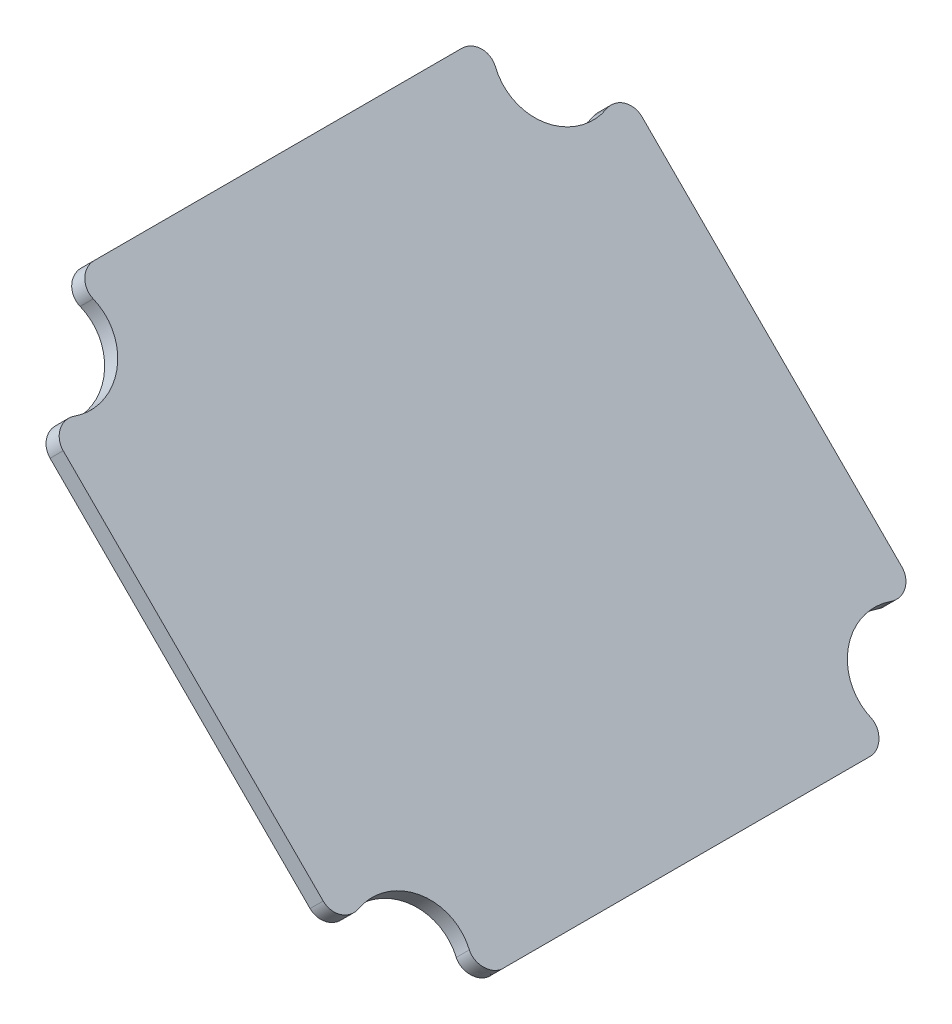
ISO-10303-21;
HEADER;
FILE_DESCRIPTION(('STEP AP214'),'2;1');
FILE_NAME('part.step','',(''),(''),'','','');
FILE_SCHEMA(('AUTOMOTIVE_DESIGN { 1 0 10303 214 1 1 1 1 }'));
ENDSEC;
DATA;
#1=APPLICATION_CONTEXT('core data for automotive mechanical design processes');
#2=APPLICATION_PROTOCOL_DEFINITION('international standard','automotive_design',2000,#1);
#3=PRODUCT_CONTEXT('',#1,'mechanical');
#4=PRODUCT('Part','Part','',(#3));
#5=PRODUCT_RELATED_PRODUCT_CATEGORY('part','',(#4));
#6=PRODUCT_DEFINITION_FORMATION('','',#4);
#7=PRODUCT_DEFINITION_CONTEXT('part definition',#1,'design');
#8=PRODUCT_DEFINITION('design','',#6,#7);
#9=PRODUCT_DEFINITION_SHAPE('','',#8);
#10=(LENGTH_UNIT() NAMED_UNIT(*) SI_UNIT(.MILLI.,.METRE.));
#11=(NAMED_UNIT(*) PLANE_ANGLE_UNIT() SI_UNIT($,.RADIAN.));
#12=(NAMED_UNIT(*) SI_UNIT($,.STERADIAN.) SOLID_ANGLE_UNIT());
#13=UNCERTAINTY_MEASURE_WITH_UNIT(LENGTH_MEASURE(1.E-05),#10,'distance_accuracy_value','');
#14=(GEOMETRIC_REPRESENTATION_CONTEXT(3) GLOBAL_UNCERTAINTY_ASSIGNED_CONTEXT((#13)) GLOBAL_UNIT_ASSIGNED_CONTEXT((#10,
#11,#12)) REPRESENTATION_CONTEXT('',''));
#15=CARTESIAN_POINT('',(0.,0.,0.));
#16=DIRECTION('',(0.,0.,1.));
#17=DIRECTION('',(1.,0.,0.));
#18=AXIS2_PLACEMENT_3D('',#15,#16,#17);
#19=CARTESIAN_POINT('',(16.1150195414016,24.5794856354689,12.5));
#20=DIRECTION('',(0.707106781186551,0.707106781186544,0.));
#21=DIRECTION('',(-0.707106781186544,0.707106781186551,0.));
#22=AXIS2_PLACEMENT_3D('',#19,#20,#21);
#23=CYLINDRICAL_SURFACE('',#22,2.6039506909341);
#24=CARTESIAN_POINT('',(16.7670598461853,25.2315259402525,12.5));
#25=DIRECTION('',(-0.707106781186551,-0.707106781186544,0.));
#26=DIRECTION('',(-0.202030508910427,0.20203050891043,-0.958314847499916));
#27=AXIS2_PLACEMENT_3D('',#24,#25,#26);
#28=CIRCLE('',#27,2.6039506909341);
#29=CARTESIAN_POINT('',(16.2409823629182,25.7576034235196,10.0045953907202));
#30=VERTEX_POINT('',#29);
#31=CARTESIAN_POINT('',(18.5315773672112,23.4670084192266,13.2439859116955));
#32=VERTEX_POINT('',#31);
#33=EDGE_CURVE('E161',#30,#32,#28,.T.);
#34=ORIENTED_EDGE('',*,*,#33,.F.);
#35=DIRECTION('',(0.707106781186551,0.707106781186544,0.));
#36=VECTOR('',#35,1.);
#37=CARTESIAN_POINT('',(15.5889420581346,25.105563118736,10.0045953907202));
#38=LINE('',#37,#36);
#39=CARTESIAN_POINT('',(15.5889420581346,25.105563118736,10.0045953907202));
#40=VERTEX_POINT('',#39);
#41=EDGE_CURVE('E33',#40,#30,#38,.T.);
#42=ORIENTED_EDGE('',*,*,#41,.F.);
#43=CARTESIAN_POINT('',(16.1150195414016,24.5794856354689,12.5));
#44=DIRECTION('',(-0.707106781186551,-0.707106781186544,0.));
#45=DIRECTION('',(-0.202030508910427,0.20203050891043,-0.958314847499916));
#46=AXIS2_PLACEMENT_3D('',#43,#44,#45);
#47=CIRCLE('',#46,2.6039506909341);
#48=CARTESIAN_POINT('',(17.8795370624275,22.814968114443,13.2439859116955));
#49=VERTEX_POINT('',#48);
#50=EDGE_CURVE('E215',#40,#49,#47,.T.);
#51=ORIENTED_EDGE('',*,*,#50,.T.);
#52=DIRECTION('',(0.707106781186551,0.707106781186544,0.));
#53=VECTOR('',#52,1.);
#54=CARTESIAN_POINT('',(17.8795370624275,22.814968114443,13.2439859116955));
#55=LINE('',#54,#53);
#56=EDGE_CURVE('E11',#49,#32,#55,.T.);
#57=ORIENTED_EDGE('',*,*,#56,.T.);
#58=EDGE_LOOP('',(#34,#42,#51,#57));
#59=FACE_BOUND('',#58,.T.);
#60=ADVANCED_FACE('F17',(#59),#23,.F.);
#61=CARTESIAN_POINT('',(18.4867277865279,22.2077773903426,13.5));
#62=DIRECTION('',(0.707106781186551,0.707106781186544,0.));
#63=DIRECTION('',(-0.707106781186544,0.707106781186551,0.));
#64=AXIS2_PLACEMENT_3D('',#61,#62,#63);
#65=CYLINDRICAL_SURFACE('',#64,0.896049309065901);
#66=CARTESIAN_POINT('',(19.1387680913116,22.8598176951262,13.5));
#67=DIRECTION('',(0.707106781186551,0.707106781186544,0.));
#68=DIRECTION('',(-0.677630927178935,0.677630927178943,-0.285714285714284));
#69=AXIS2_PLACEMENT_3D('',#66,#67,#68);
#70=CIRCLE('',#69,0.896049309065901);
#71=CARTESIAN_POINT('',(19.1387680913116,22.8598176951262,14.3960493090659));
#72=VERTEX_POINT('',#71);
#73=EDGE_CURVE('E164',#32,#72,#70,.T.);
#74=ORIENTED_EDGE('',*,*,#73,.F.);
#75=ORIENTED_EDGE('',*,*,#56,.F.);
#76=CARTESIAN_POINT('',(18.4867277865279,22.2077773903426,13.5));
#77=DIRECTION('',(0.707106781186551,0.707106781186544,0.));
#78=DIRECTION('',(-0.677630927178935,0.677630927178943,-0.285714285714284));
#79=AXIS2_PLACEMENT_3D('',#76,#77,#78);
#80=CIRCLE('',#79,0.896049309065901);
#81=CARTESIAN_POINT('',(18.4867277865279,22.2077773903426,14.3960493090659));
#82=VERTEX_POINT('',#81);
#83=EDGE_CURVE('E240',#49,#82,#80,.T.);
#84=ORIENTED_EDGE('',*,*,#83,.T.);
#85=DIRECTION('',(0.707106781186551,0.707106781186544,0.));
#86=VECTOR('',#85,1.);
#87=CARTESIAN_POINT('',(18.4867277865279,22.2077773903426,14.3960493090659));
#88=LINE('',#87,#86);
#89=EDGE_CURVE('E25',#82,#72,#88,.T.);
#90=ORIENTED_EDGE('',*,*,#89,.T.);
#91=EDGE_LOOP('',(#74,#75,#84,#90));
#92=FACE_BOUND('',#91,.T.);
#93=ADVANCED_FACE('F239',(#92),#65,.T.);
#94=CARTESIAN_POINT('',(18.4867277865279,22.2077773903426,14.3960493090659));
#95=DIRECTION('',(0.,0.,1.));
#96=DIRECTION('',(1.,0.,0.));
#97=AXIS2_PLACEMENT_3D('',#94,#95,#96);
#98=PLANE('',#97);
#99=DIRECTION('',(0.707106781186544,-0.707106781186551,0.));
#100=VECTOR('',#99,1.);
#101=CARTESIAN_POINT('',(19.1387680913116,22.8598176951262,14.3960493090659));
#102=LINE('',#101,#100);
#103=CARTESIAN_POINT('',(32.0730211307226,9.92556465571507,14.3960493090659));
#104=VERTEX_POINT('',#103);
#105=EDGE_CURVE('E167',#72,#104,#102,.T.);
#106=ORIENTED_EDGE('',*,*,#105,.F.);
#107=ORIENTED_EDGE('',*,*,#89,.F.);
#108=DIRECTION('',(0.707106781186544,-0.707106781186551,0.));
#109=VECTOR('',#108,1.);
#110=CARTESIAN_POINT('',(18.4867277865279,22.2077773903426,14.3960493090659));
#111=LINE('',#110,#109);
#112=CARTESIAN_POINT('',(31.4209808259389,9.27352435093144,14.3960493090659));
#113=VERTEX_POINT('',#112);
#114=EDGE_CURVE('E249',#82,#113,#111,.T.);
#115=ORIENTED_EDGE('',*,*,#114,.T.);
#116=DIRECTION('',(0.707106781186551,0.707106781186544,0.));
#117=VECTOR('',#116,1.);
#118=CARTESIAN_POINT('',(31.4209808259389,9.27352435093144,14.3960493090659));
#119=LINE('',#118,#117);
#120=EDGE_CURVE('E237',#113,#104,#119,.T.);
#121=ORIENTED_EDGE('',*,*,#120,.T.);
#122=EDGE_LOOP('',(#106,#107,#115,#121));
#123=FACE_BOUND('',#122,.T.);
#124=ADVANCED_FACE('F244',(#123),#98,.T.);
#125=CARTESIAN_POINT('',(31.420980825939,9.27352435093142,13.5));
#126=DIRECTION('',(0.707106781186551,0.707106781186544,0.));
#127=DIRECTION('',(-0.707106781186544,0.707106781186551,0.));
#128=AXIS2_PLACEMENT_3D('',#125,#126,#127);
#129=CYLINDRICAL_SURFACE('',#128,0.896049309065901);
#130=CARTESIAN_POINT('',(32.0730211307226,9.92556465571506,13.5));
#131=DIRECTION('',(0.707106781186551,0.707106781186544,0.));
#132=DIRECTION('',(0.,0.,1.));
#133=AXIS2_PLACEMENT_3D('',#130,#131,#132);
#134=CIRCLE('',#133,0.896049309065901);
#135=CARTESIAN_POINT('',(32.680211854823,9.31837393161468,13.2439859116955));
#136=VERTEX_POINT('',#135);
#137=EDGE_CURVE('E170',#104,#136,#134,.T.);
#138=ORIENTED_EDGE('',*,*,#137,.F.);
#139=ORIENTED_EDGE('',*,*,#120,.F.);
#140=CARTESIAN_POINT('',(31.420980825939,9.27352435093142,13.5));
#141=DIRECTION('',(0.707106781186551,0.707106781186544,0.));
#142=DIRECTION('',(0.,0.,1.));
#143=AXIS2_PLACEMENT_3D('',#140,#141,#142);
#144=CIRCLE('',#143,0.896049309065901);
#145=CARTESIAN_POINT('',(32.0281715500393,8.66633362683105,13.2439859116955));
#146=VERTEX_POINT('',#145);
#147=EDGE_CURVE('E253',#113,#146,#144,.T.);
#148=ORIENTED_EDGE('',*,*,#147,.T.);
#149=DIRECTION('',(0.707106781186551,0.707106781186544,0.));
#150=VECTOR('',#149,1.);
#151=CARTESIAN_POINT('',(32.0281715500393,8.66633362683105,13.2439859116955));
#152=LINE('',#151,#150);
#153=EDGE_CURVE('E235',#146,#136,#152,.T.);
#154=ORIENTED_EDGE('',*,*,#153,.T.);
#155=EDGE_LOOP('',(#138,#139,#148,#154));
#156=FACE_BOUND('',#155,.T.);
#157=ADVANCED_FACE('F281',(#156),#129,.T.);
#158=CARTESIAN_POINT('',(33.7926890710652,6.90181610580512,12.5));
#159=DIRECTION('',(0.707106781186551,0.707106781186544,0.));
#160=DIRECTION('',(-0.707106781186544,0.707106781186551,0.));
#161=AXIS2_PLACEMENT_3D('',#158,#159,#160);
#162=CYLINDRICAL_SURFACE('',#161,2.6039506909341);
#163=CARTESIAN_POINT('',(34.4447293758489,7.55385641058876,12.5));
#164=DIRECTION('',(-0.707106781186551,-0.707106781186544,0.));
#165=DIRECTION('',(-0.677630927178935,0.677630927178942,0.285714285714285));
#166=AXIS2_PLACEMENT_3D('',#163,#164,#165);
#167=CIRCLE('',#166,2.6039506909341);
#168=CARTESIAN_POINT('',(34.9437513425845,7.05483444385308,9.99350576417047));
#169=VERTEX_POINT('',#168);
#170=EDGE_CURVE('E173',#136,#169,#167,.T.);
#171=ORIENTED_EDGE('',*,*,#170,.F.);
#172=ORIENTED_EDGE('',*,*,#153,.F.);
#173=CARTESIAN_POINT('',(33.7926890710652,6.90181610580512,12.5));
#174=DIRECTION('',(-0.707106781186551,-0.707106781186544,0.));
#175=DIRECTION('',(-0.677630927178935,0.677630927178942,0.285714285714285));
#176=AXIS2_PLACEMENT_3D('',#173,#174,#175);
#177=CIRCLE('',#176,2.6039506909341);
#178=CARTESIAN_POINT('',(34.2917110378009,6.40279413906944,9.99350576417047));
#179=VERTEX_POINT('',#178);
#180=EDGE_CURVE('E256',#146,#179,#177,.T.);
#181=ORIENTED_EDGE('',*,*,#180,.T.);
#182=DIRECTION('',(0.707106781186551,0.707106781186544,0.));
#183=VECTOR('',#182,1.);
#184=CARTESIAN_POINT('',(34.2917110378009,6.40279413906944,9.99350576417047));
#185=LINE('',#184,#183);
#186=EDGE_CURVE('E233',#179,#169,#185,.T.);
#187=ORIENTED_EDGE('',*,*,#186,.T.);
#188=EDGE_LOOP('',(#171,#172,#181,#187));
#189=FACE_BOUND('',#188,.T.);
#190=ADVANCED_FACE('F276',(#189),#162,.F.);
#191=CARTESIAN_POINT('',(34.2917110378009,6.40279413906944,9.99350576417047));
#192=CARTESIAN_POINT('',(34.6614578443524,6.03304733251817,10.1407327363789));
#193=CARTESIAN_POINT('',(35.1094049893612,5.5851001875092,9.70988638517898));
#194=CARTESIAN_POINT('',(35.1094049893612,5.58510018750918,9.14080700688087));
#195=B_SPLINE_CURVE_WITH_KNOTS('',3,(#191,#192,#193,#194),.UNSPECIFIED.,.F.,.F.,(4,4),(0.,1.),.UNSPECIFIED.);
#196=DIRECTION('',(0.707106781186551,0.707106781186544,0.));
#197=VECTOR('',#196,1.);
#198=SURFACE_OF_LINEAR_EXTRUSION('',#195,#197);
#199=CARTESIAN_POINT('',(34.9437513425845,7.05483444385307,9.99350576417047));
#200=CARTESIAN_POINT('',(35.3134981491361,6.68508763730181,10.1407327363789));
#201=CARTESIAN_POINT('',(35.7614452941448,6.23714049229283,9.70988638517898));
#202=CARTESIAN_POINT('',(35.7614452941448,6.23714049229281,9.14080700688087));
#203=B_SPLINE_CURVE_WITH_KNOTS('',3,(#199,#200,#201,#202),.UNSPECIFIED.,.F.,.F.,(4,4),(0.,1.),.UNSPECIFIED.);
#204=CARTESIAN_POINT('',(35.7614452941448,6.23714049229281,9.14080700688086));
#205=VERTEX_POINT('',#204);
#206=EDGE_CURVE('E176',#169,#205,#203,.T.);
#207=ORIENTED_EDGE('',*,*,#206,.F.);
#208=ORIENTED_EDGE('',*,*,#186,.F.);
#209=CARTESIAN_POINT('',(35.1094049893612,5.58510018750917,9.14080700688086));
#210=VERTEX_POINT('',#209);
#211=EDGE_CURVE('E259',#179,#210,#195,.T.);
#212=ORIENTED_EDGE('',*,*,#211,.T.);
#213=DIRECTION('',(0.707106781186551,0.707106781186544,0.));
#214=VECTOR('',#213,1.);
#215=CARTESIAN_POINT('',(35.1094049893612,5.58510018750917,9.14080700688086));
#216=LINE('',#215,#214);
#217=EDGE_CURVE('E231',#210,#205,#216,.T.);
#218=ORIENTED_EDGE('',*,*,#217,.T.);
#219=EDGE_LOOP('',(#207,#208,#212,#218));
#220=FACE_BOUND('',#219,.T.);
#221=ADVANCED_FACE('F271',(#220),#198,.T.);
#222=CARTESIAN_POINT('',(35.1094049893612,5.58510018750917,9.14080700688086));
#223=DIRECTION('',(0.707106781186544,-0.707106781186551,0.));
#224=DIRECTION('',(0.707106781186551,0.707106781186544,0.));
#225=AXIS2_PLACEMENT_3D('',#222,#223,#224);
#226=PLANE('',#225);
#227=DIRECTION('',(0.,0.,-1.));
#228=VECTOR('',#227,1.);
#229=CARTESIAN_POINT('',(35.7614452941448,6.23714049229281,9.14080700688086));
#230=LINE('',#229,#228);
#231=CARTESIAN_POINT('',(35.7614452941448,6.23714049229281,-9.14080700688087));
#232=VERTEX_POINT('',#231);
#233=EDGE_CURVE('E181',#205,#232,#230,.T.);
#234=ORIENTED_EDGE('',*,*,#233,.F.);
#235=ORIENTED_EDGE('',*,*,#217,.F.);
#236=DIRECTION('',(0.,0.,-1.));
#237=VECTOR('',#236,1.);
#238=CARTESIAN_POINT('',(35.1094049893612,5.58510018750917,9.14080700688086));
#239=LINE('',#238,#237);
#240=CARTESIAN_POINT('',(35.1094049893612,5.58510018750918,-9.14080700688087));
#241=VERTEX_POINT('',#240);
#242=EDGE_CURVE('E265',#210,#241,#239,.T.);
#243=ORIENTED_EDGE('',*,*,#242,.T.);
#244=DIRECTION('',(0.707106781186551,0.707106781186544,0.));
#245=VECTOR('',#244,1.);
#246=CARTESIAN_POINT('',(35.1094049893612,5.58510018750918,-9.14080700688087));
#247=LINE('',#246,#245);
#248=EDGE_CURVE('E229',#241,#232,#247,.T.);
#249=ORIENTED_EDGE('',*,*,#248,.T.);
#250=EDGE_LOOP('',(#234,#235,#243,#249));
#251=FACE_BOUND('',#250,.T.);
#252=ADVANCED_FACE('F275',(#251),#226,.T.);
#253=CARTESIAN_POINT('',(35.1094049893612,5.58510018750917,-9.14080700688087));
#254=CARTESIAN_POINT('',(35.1094049893612,5.58510018750919,-9.70927535690683));
#255=CARTESIAN_POINT('',(34.6612010844855,6.03330409238486,-10.1406304989138));
#256=CARTESIAN_POINT('',(34.2917110377989,6.40279413907142,-9.99350576416968));
#257=B_SPLINE_CURVE_WITH_KNOTS('',3,(#253,#254,#255,#256),.UNSPECIFIED.,.F.,.F.,(4,4),(0.,1.),.UNSPECIFIED.);
#258=DIRECTION('',(0.707106781186551,0.707106781186544,0.));
#259=VECTOR('',#258,1.);
#260=SURFACE_OF_LINEAR_EXTRUSION('',#257,#259);
#261=CARTESIAN_POINT('',(35.7614452941448,6.23714049229281,-9.14080700688087));
#262=CARTESIAN_POINT('',(35.7614452941448,6.23714049229283,-9.70927535690683));
#263=CARTESIAN_POINT('',(35.3132413892692,6.68534439716849,-10.1406304989138));
#264=CARTESIAN_POINT('',(34.9437513425826,7.05483444385506,-9.99350576416968));
#265=B_SPLINE_CURVE_WITH_KNOTS('',3,(#261,#262,#263,#264),.UNSPECIFIED.,.F.,.F.,(4,4),(0.,1.),.UNSPECIFIED.);
#266=CARTESIAN_POINT('',(34.9437513425846,7.05483444385307,-9.99350576417047));
#267=VERTEX_POINT('',#266);
#268=EDGE_CURVE('E187',#232,#267,#265,.T.);
#269=ORIENTED_EDGE('',*,*,#268,.F.);
#270=ORIENTED_EDGE('',*,*,#248,.F.);
#271=CARTESIAN_POINT('',(34.2917110378009,6.40279413906944,-9.99350576417047));
#272=VERTEX_POINT('',#271);
#273=EDGE_CURVE('E461',#241,#272,#257,.T.);
#274=ORIENTED_EDGE('',*,*,#273,.T.);
#275=DIRECTION('',(0.707106781186551,0.707106781186544,0.));
#276=VECTOR('',#275,1.);
#277=CARTESIAN_POINT('',(34.2917110378009,6.40279413906944,-9.99350576417047));
#278=LINE('',#277,#276);
#279=EDGE_CURVE('E227',#272,#267,#278,.T.);
#280=ORIENTED_EDGE('',*,*,#279,.T.);
#281=EDGE_LOOP('',(#269,#270,#274,#280));
#282=FACE_BOUND('',#281,.T.);
#283=ADVANCED_FACE('F371',(#282),#260,.T.);
#284=CARTESIAN_POINT('',(33.7926890710652,6.90181610580512,-12.5));
#285=DIRECTION('',(0.707106781186551,0.707106781186544,0.));
#286=DIRECTION('',(-0.707106781186544,0.707106781186551,0.));
#287=AXIS2_PLACEMENT_3D('',#284,#285,#286);
#288=CYLINDRICAL_SURFACE('',#287,2.6039506909341);
#289=CARTESIAN_POINT('',(34.4447293758489,7.55385641058876,-12.5));
#290=DIRECTION('',(-0.707106781186551,-0.707106781186544,0.));
#291=DIRECTION('',(0.1916403288561,-0.191640328856102,0.962573617294724));
#292=AXIS2_PLACEMENT_3D('',#289,#290,#291);
#293=CIRCLE('',#292,2.6039506909341);
#294=CARTESIAN_POINT('',(32.680211854823,9.31837393161467,-13.2439859116955));
#295=VERTEX_POINT('',#294);
#296=EDGE_CURVE('E192',#267,#295,#293,.T.);
#297=ORIENTED_EDGE('',*,*,#296,.F.);
#298=ORIENTED_EDGE('',*,*,#279,.F.);
#299=CARTESIAN_POINT('',(33.7926890710652,6.90181610580512,-12.5));
#300=DIRECTION('',(-0.707106781186551,-0.707106781186544,0.));
#301=DIRECTION('',(0.1916403288561,-0.191640328856102,0.962573617294724));
#302=AXIS2_PLACEMENT_3D('',#299,#300,#301);
#303=CIRCLE('',#302,2.6039506909341);
#304=CARTESIAN_POINT('',(32.0281715500393,8.66633362683104,-13.2439859116955));
#305=VERTEX_POINT('',#304);
#306=EDGE_CURVE('E462',#272,#305,#303,.T.);
#307=ORIENTED_EDGE('',*,*,#306,.T.);
#308=DIRECTION('',(0.707106781186551,0.707106781186544,0.));
#309=VECTOR('',#308,1.);
#310=CARTESIAN_POINT('',(32.0281715500393,8.66633362683104,-13.2439859116955));
#311=LINE('',#310,#309);
#312=EDGE_CURVE('E225',#305,#295,#311,.T.);
#313=ORIENTED_EDGE('',*,*,#312,.T.);
#314=EDGE_LOOP('',(#297,#298,#307,#313));
#315=FACE_BOUND('',#314,.T.);
#316=ADVANCED_FACE('F363',(#315),#288,.F.);
#317=CARTESIAN_POINT('',(31.420980825939,9.27352435093142,-13.5));
#318=DIRECTION('',(0.707106781186551,0.707106781186544,0.));
#319=DIRECTION('',(-0.707106781186544,0.707106781186551,0.));
#320=AXIS2_PLACEMENT_3D('',#317,#318,#319);
#321=CYLINDRICAL_SURFACE('',#320,0.896049309065901);
#322=CARTESIAN_POINT('',(32.0730211307226,9.92556465571506,-13.5));
#323=DIRECTION('',(0.707106781186551,0.707106781186544,0.));
#324=DIRECTION('',(0.677630927178935,-0.677630927178942,0.285714285714286));
#325=AXIS2_PLACEMENT_3D('',#322,#323,#324);
#326=CIRCLE('',#325,0.896049309065901);
#327=CARTESIAN_POINT('',(32.0730211307226,9.92556465571505,-14.3960493090659));
#328=VERTEX_POINT('',#327);
#329=EDGE_CURVE('E198',#295,#328,#326,.T.);
#330=ORIENTED_EDGE('',*,*,#329,.F.);
#331=ORIENTED_EDGE('',*,*,#312,.F.);
#332=CARTESIAN_POINT('',(31.420980825939,9.27352435093142,-13.5));
#333=DIRECTION('',(0.707106781186551,0.707106781186544,0.));
#334=DIRECTION('',(0.677630927178935,-0.677630927178942,0.285714285714286));
#335=AXIS2_PLACEMENT_3D('',#332,#333,#334);
#336=CIRCLE('',#335,0.896049309065901);
#337=CARTESIAN_POINT('',(31.420980825939,9.27352435093142,-14.3960493090659));
#338=VERTEX_POINT('',#337);
#339=EDGE_CURVE('E464',#305,#338,#336,.T.);
#340=ORIENTED_EDGE('',*,*,#339,.T.);
#341=DIRECTION('',(0.707106781186551,0.707106781186544,0.));
#342=VECTOR('',#341,1.);
#343=CARTESIAN_POINT('',(31.420980825939,9.27352435093142,-14.3960493090659));
#344=LINE('',#343,#342);
#345=EDGE_CURVE('E223',#338,#328,#344,.T.);
#346=ORIENTED_EDGE('',*,*,#345,.T.);
#347=EDGE_LOOP('',(#330,#331,#340,#346));
#348=FACE_BOUND('',#347,.T.);
#349=ADVANCED_FACE('F355',(#348),#321,.T.);
#350=CARTESIAN_POINT('',(31.420980825939,9.27352435093142,-14.3960493090659));
#351=DIRECTION('',(0.,0.,-1.));
#352=DIRECTION('',(-1.,0.,0.));
#353=AXIS2_PLACEMENT_3D('',#350,#351,#352);
#354=PLANE('',#353);
#355=DIRECTION('',(-0.707106781186544,0.707106781186551,0.));
#356=VECTOR('',#355,1.);
#357=CARTESIAN_POINT('',(32.0730211307226,9.92556465571505,-14.3960493090659));
#358=LINE('',#357,#356);
#359=CARTESIAN_POINT('',(19.1387680913115,22.8598176951262,-14.3960493090659));
#360=VERTEX_POINT('',#359);
#361=EDGE_CURVE('E201',#328,#360,#358,.T.);
#362=ORIENTED_EDGE('',*,*,#361,.F.);
#363=ORIENTED_EDGE('',*,*,#345,.F.);
#364=DIRECTION('',(-0.707106781186544,0.707106781186551,0.));
#365=VECTOR('',#364,1.);
#366=CARTESIAN_POINT('',(31.420980825939,9.27352435093142,-14.3960493090659));
#367=LINE('',#366,#365);
#368=CARTESIAN_POINT('',(18.4867277865279,22.2077773903426,-14.3960493090659));
#369=VERTEX_POINT('',#368);
#370=EDGE_CURVE('E475',#338,#369,#367,.T.);
#371=ORIENTED_EDGE('',*,*,#370,.T.);
#372=DIRECTION('',(0.707106781186551,0.707106781186544,0.));
#373=VECTOR('',#372,1.);
#374=CARTESIAN_POINT('',(18.4867277865279,22.2077773903426,-14.3960493090659));
#375=LINE('',#374,#373);
#376=EDGE_CURVE('E221',#369,#360,#375,.T.);
#377=ORIENTED_EDGE('',*,*,#376,.T.);
#378=EDGE_LOOP('',(#362,#363,#371,#377));
#379=FACE_BOUND('',#378,.T.);
#380=ADVANCED_FACE('F347',(#379),#354,.T.);
#381=CARTESIAN_POINT('',(18.4867277865279,22.2077773903426,-13.5));
#382=DIRECTION('',(0.707106781186551,0.707106781186544,0.));
#383=DIRECTION('',(-0.707106781186544,0.707106781186551,0.));
#384=AXIS2_PLACEMENT_3D('',#381,#382,#383);
#385=CYLINDRICAL_SURFACE('',#384,0.896049309065901);
#386=CARTESIAN_POINT('',(19.1387680913115,22.8598176951262,-13.5));
#387=DIRECTION('',(0.707106781186551,0.707106781186544,0.));
#388=DIRECTION('',(0.,0.,-1.));
#389=AXIS2_PLACEMENT_3D('',#386,#387,#388);
#390=CIRCLE('',#389,0.896049309065901);
#391=CARTESIAN_POINT('',(18.5315773672112,23.4670084192266,-13.2439859116955));
#392=VERTEX_POINT('',#391);
#393=EDGE_CURVE('E204',#360,#392,#390,.T.);
#394=ORIENTED_EDGE('',*,*,#393,.F.);
#395=ORIENTED_EDGE('',*,*,#376,.F.);
#396=CARTESIAN_POINT('',(18.4867277865279,22.2077773903426,-13.5));
#397=DIRECTION('',(0.707106781186551,0.707106781186544,0.));
#398=DIRECTION('',(0.,0.,-1.));
#399=AXIS2_PLACEMENT_3D('',#396,#397,#398);
#400=CIRCLE('',#399,0.896049309065901);
#401=CARTESIAN_POINT('',(17.8795370624275,22.814968114443,-13.2439859116955));
#402=VERTEX_POINT('',#401);
#403=EDGE_CURVE('E478',#369,#402,#400,.T.);
#404=ORIENTED_EDGE('',*,*,#403,.T.);
#405=DIRECTION('',(0.707106781186551,0.707106781186544,0.));
#406=VECTOR('',#405,1.);
#407=CARTESIAN_POINT('',(17.8795370624275,22.814968114443,-13.2439859116955));
#408=LINE('',#407,#406);
#409=EDGE_CURVE('E219',#402,#392,#408,.T.);
#410=ORIENTED_EDGE('',*,*,#409,.T.);
#411=EDGE_LOOP('',(#394,#395,#404,#410));
#412=FACE_BOUND('',#411,.T.);
#413=ADVANCED_FACE('F339',(#412),#385,.T.);
#414=CARTESIAN_POINT('',(16.1150195414016,24.5794856354689,-12.5));
#415=DIRECTION('',(0.707106781186551,0.707106781186544,0.));
#416=DIRECTION('',(-0.707106781186544,0.707106781186551,0.));
#417=AXIS2_PLACEMENT_3D('',#414,#415,#416);
#418=CYLINDRICAL_SURFACE('',#417,2.6039506909341);
#419=CARTESIAN_POINT('',(16.7670598461853,25.2315259402525,-12.5));
#420=DIRECTION('',(-0.707106781186551,-0.707106781186544,0.));
#421=DIRECTION('',(0.677630927178935,-0.677630927178942,-0.285714285714286));
#422=AXIS2_PLACEMENT_3D('',#419,#420,#421);
#423=CIRCLE('',#422,2.6039506909341);
#424=CARTESIAN_POINT('',(16.2409823629182,25.7576034235196,-10.0045953907202));
#425=VERTEX_POINT('',#424);
#426=EDGE_CURVE('E207',#392,#425,#423,.T.);
#427=ORIENTED_EDGE('',*,*,#426,.F.);
#428=ORIENTED_EDGE('',*,*,#409,.F.);
#429=CARTESIAN_POINT('',(16.1150195414016,24.5794856354689,-12.5));
#430=DIRECTION('',(-0.707106781186551,-0.707106781186544,0.));
#431=DIRECTION('',(0.677630927178935,-0.677630927178942,-0.285714285714286));
#432=AXIS2_PLACEMENT_3D('',#429,#430,#431);
#433=CIRCLE('',#432,2.6039506909341);
#434=CARTESIAN_POINT('',(15.5889420581346,25.105563118736,-10.0045953907202));
#435=VERTEX_POINT('',#434);
#436=EDGE_CURVE('E152',#402,#435,#433,.T.);
#437=ORIENTED_EDGE('',*,*,#436,.T.);
#438=DIRECTION('',(0.707106781186551,0.707106781186544,0.));
#439=VECTOR('',#438,1.);
#440=CARTESIAN_POINT('',(15.5889420581346,25.105563118736,-10.0045953907202));
#441=LINE('',#440,#439);
#442=EDGE_CURVE('E144',#435,#425,#441,.T.);
#443=ORIENTED_EDGE('',*,*,#442,.T.);
#444=EDGE_LOOP('',(#427,#428,#437,#443));
#445=FACE_BOUND('',#444,.T.);
#446=ADVANCED_FACE('F332',(#445),#418,.F.);
#447=CARTESIAN_POINT('',(15.4079127602151,25.2865924166554,-9.1458980337503));
#448=DIRECTION('',(0.707106781186551,0.707106781186544,0.));
#449=DIRECTION('',(-0.707106781186544,0.707106781186551,0.));
#450=AXIS2_PLACEMENT_3D('',#447,#448,#449);
#451=CYLINDRICAL_SURFACE('',#450,0.896049309065899);
#452=CARTESIAN_POINT('',(16.0599530649988,25.938632721439,-9.1458980337503));
#453=DIRECTION('',(0.707106781186551,0.707106781186544,0.));
#454=DIRECTION('',(0.202030508910432,-0.202030508910436,-0.958314847499913));
#455=AXIS2_PLACEMENT_3D('',#452,#453,#454);
#456=CIRCLE('',#455,0.896049309065899);
#457=CARTESIAN_POINT('',(15.4263505222807,26.5722352641571,-9.1458980337503));
#458=VERTEX_POINT('',#457);
#459=EDGE_CURVE('E210',#425,#458,#456,.T.);
#460=ORIENTED_EDGE('',*,*,#459,.F.);
#461=ORIENTED_EDGE('',*,*,#442,.F.);
#462=CARTESIAN_POINT('',(15.4079127602151,25.2865924166554,-9.1458980337503));
#463=DIRECTION('',(0.707106781186551,0.707106781186544,0.));
#464=DIRECTION('',(0.202030508910432,-0.202030508910436,-0.958314847499913));
#465=AXIS2_PLACEMENT_3D('',#462,#463,#464);
#466=CIRCLE('',#465,0.896049309065899);
#467=CARTESIAN_POINT('',(14.7743102174971,25.9201949593735,-9.1458980337503));
#468=VERTEX_POINT('',#467);
#469=EDGE_CURVE('E147',#435,#468,#466,.T.);
#470=ORIENTED_EDGE('',*,*,#469,.T.);
#471=DIRECTION('',(0.707106781186551,0.707106781186544,0.));
#472=VECTOR('',#471,1.);
#473=CARTESIAN_POINT('',(14.7743102174971,25.9201949593735,-9.1458980337503));
#474=LINE('',#473,#472);
#475=EDGE_CURVE('E133',#468,#458,#474,.T.);
#476=ORIENTED_EDGE('',*,*,#475,.T.);
#477=EDGE_LOOP('',(#460,#461,#470,#476));
#478=FACE_BOUND('',#477,.T.);
#479=ADVANCED_FACE('F148',(#478),#451,.T.);
#480=CARTESIAN_POINT('',(14.7743102174971,25.9201949593735,-9.1458980337503));
#481=DIRECTION('',(-0.707106781186544,0.707106781186551,0.));
#482=DIRECTION('',(-0.707106781186551,-0.707106781186544,0.));
#483=AXIS2_PLACEMENT_3D('',#480,#481,#482);
#484=PLANE('',#483);
#485=DIRECTION('',(0.,0.,1.));
#486=VECTOR('',#485,1.);
#487=CARTESIAN_POINT('',(15.4263505222807,26.5722352641571,-9.1458980337503));
#488=LINE('',#487,#486);
#489=CARTESIAN_POINT('',(15.4263505222808,26.5722352641571,9.1458980337503));
#490=VERTEX_POINT('',#489);
#491=EDGE_CURVE('E140',#458,#490,#488,.T.);
#492=ORIENTED_EDGE('',*,*,#491,.F.);
#493=ORIENTED_EDGE('',*,*,#475,.F.);
#494=DIRECTION('',(0.,0.,1.));
#495=VECTOR('',#494,1.);
#496=CARTESIAN_POINT('',(14.7743102174971,25.9201949593735,-9.1458980337503));
#497=LINE('',#496,#495);
#498=CARTESIAN_POINT('',(14.7743102174971,25.9201949593734,9.1458980337503));
#499=VERTEX_POINT('',#498);
#500=EDGE_CURVE('E137',#468,#499,#497,.T.);
#501=ORIENTED_EDGE('',*,*,#500,.T.);
#502=DIRECTION('',(0.707106781186551,0.707106781186544,0.));
#503=VECTOR('',#502,1.);
#504=CARTESIAN_POINT('',(14.7743102174971,25.9201949593734,9.1458980337503));
#505=LINE('',#504,#503);
#506=EDGE_CURVE('E85',#499,#490,#505,.T.);
#507=ORIENTED_EDGE('',*,*,#506,.T.);
#508=EDGE_LOOP('',(#492,#493,#501,#507));
#509=FACE_BOUND('',#508,.T.);
#510=ADVANCED_FACE('F135',(#509),#484,.T.);
#511=CARTESIAN_POINT('',(15.4079127602151,25.2865924166554,9.1458980337503));
#512=DIRECTION('',(0.707106781186551,0.707106781186544,0.));
#513=DIRECTION('',(-0.707106781186544,0.707106781186551,0.));
#514=AXIS2_PLACEMENT_3D('',#511,#512,#513);
#515=CYLINDRICAL_SURFACE('',#514,0.896049309065901);
#516=CARTESIAN_POINT('',(16.0599530649988,25.938632721439,9.1458980337503));
#517=DIRECTION('',(0.707106781186551,0.707106781186544,0.));
#518=DIRECTION('',(-0.707106781186544,0.707106781186551,0.));
#519=AXIS2_PLACEMENT_3D('',#516,#517,#518);
#520=CIRCLE('',#519,0.896049309065901);
#521=EDGE_CURVE('E213',#490,#30,#520,.T.);
#522=ORIENTED_EDGE('',*,*,#521,.F.);
#523=ORIENTED_EDGE('',*,*,#506,.F.);
#524=CARTESIAN_POINT('',(15.4079127602151,25.2865924166554,9.1458980337503));
#525=DIRECTION('',(0.707106781186551,0.707106781186544,0.));
#526=DIRECTION('',(-0.707106781186544,0.707106781186551,0.));
#527=AXIS2_PLACEMENT_3D('',#524,#525,#526);
#528=CIRCLE('',#527,0.896049309065901);
#529=EDGE_CURVE('E156',#499,#40,#528,.T.);
#530=ORIENTED_EDGE('',*,*,#529,.T.);
#531=ORIENTED_EDGE('',*,*,#41,.T.);
#532=EDGE_LOOP('',(#522,#523,#530,#531));
#533=FACE_BOUND('',#532,.T.);
#534=ADVANCED_FACE('F308',(#533),#515,.T.);
#535=CARTESIAN_POINT('',(34.8295432811465,5.86496189572387,0.));
#536=DIRECTION('',(0.707106781186551,0.707106781186544,0.));
#537=DIRECTION('',(-0.707106781186544,0.707106781186551,0.));
#538=AXIS2_PLACEMENT_3D('',#535,#536,#537);
#539=PLANE('',#538);
#540=ORIENTED_EDGE('',*,*,#50,.F.);
#541=ORIENTED_EDGE('',*,*,#529,.F.);
#542=ORIENTED_EDGE('',*,*,#500,.F.);
#543=ORIENTED_EDGE('',*,*,#469,.F.);
#544=ORIENTED_EDGE('',*,*,#436,.F.);
#545=ORIENTED_EDGE('',*,*,#403,.F.);
#546=ORIENTED_EDGE('',*,*,#370,.F.);
#547=ORIENTED_EDGE('',*,*,#339,.F.);
#548=ORIENTED_EDGE('',*,*,#306,.F.);
#549=ORIENTED_EDGE('',*,*,#273,.F.);
#550=ORIENTED_EDGE('',*,*,#242,.F.);
#551=ORIENTED_EDGE('',*,*,#211,.F.);
#552=ORIENTED_EDGE('',*,*,#180,.F.);
#553=ORIENTED_EDGE('',*,*,#147,.F.);
#554=ORIENTED_EDGE('',*,*,#114,.F.);
#555=ORIENTED_EDGE('',*,*,#83,.F.);
#556=EDGE_LOOP('',(#540,#541,#542,#543,#544,#545,#546,#547,#548,#549,#550,#551,#552,#553,#554,#555));
#557=FACE_BOUND('',#556,.T.);
#558=ADVANCED_FACE('F155',(#557),#539,.F.);
#559=CARTESIAN_POINT('',(35.4815835859301,6.51700220050751,0.));
#560=DIRECTION('',(0.707106781186551,0.707106781186544,0.));
#561=DIRECTION('',(-0.707106781186544,0.707106781186551,0.));
#562=AXIS2_PLACEMENT_3D('',#559,#560,#561);
#563=PLANE('',#562);
#564=ORIENTED_EDGE('',*,*,#33,.T.);
#565=ORIENTED_EDGE('',*,*,#73,.T.);
#566=ORIENTED_EDGE('',*,*,#105,.T.);
#567=ORIENTED_EDGE('',*,*,#137,.T.);
#568=ORIENTED_EDGE('',*,*,#170,.T.);
#569=ORIENTED_EDGE('',*,*,#206,.T.);
#570=ORIENTED_EDGE('',*,*,#233,.T.);
#571=ORIENTED_EDGE('',*,*,#268,.T.);
#572=ORIENTED_EDGE('',*,*,#296,.T.);
#573=ORIENTED_EDGE('',*,*,#329,.T.);
#574=ORIENTED_EDGE('',*,*,#361,.T.);
#575=ORIENTED_EDGE('',*,*,#393,.T.);
#576=ORIENTED_EDGE('',*,*,#426,.T.);
#577=ORIENTED_EDGE('',*,*,#459,.T.);
#578=ORIENTED_EDGE('',*,*,#491,.T.);
#579=ORIENTED_EDGE('',*,*,#521,.T.);
#580=EDGE_LOOP('',(#564,#565,#566,#567,#568,#569,#570,#571,#572,#573,#574,#575,#576,#577,#578,#579));
#581=FACE_BOUND('',#580,.T.);
#582=ADVANCED_FACE('F247',(#581),#563,.T.);
#583=CLOSED_SHELL('',(#60,#93,#124,#157,#190,#221,#252,#283,#316,#349,#380,#413,#446,#479,#510,
#534,#558,#582));
#584=MANIFOLD_SOLID_BREP('B1',#583);
#585=ADVANCED_BREP_SHAPE_REPRESENTATION('',(#18,#584),#14);
#586=SHAPE_DEFINITION_REPRESENTATION(#9,#585);
ENDSEC;
END-ISO-10303-21;
